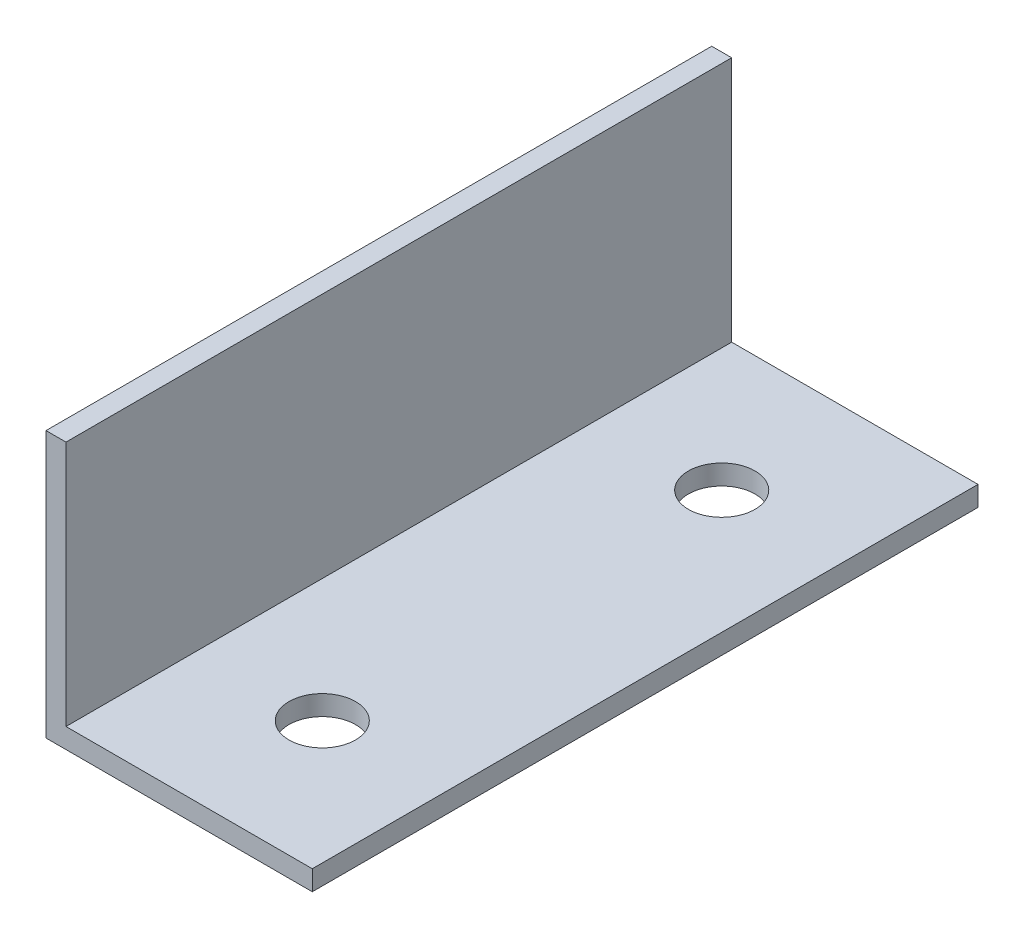
ISO-10303-21;
HEADER;
FILE_DESCRIPTION(('STEP AP214'),'2;1');
FILE_NAME('part.step','',(''),(''),'','','');
FILE_SCHEMA(('AUTOMOTIVE_DESIGN { 1 0 10303 214 1 1 1 1 }'));
ENDSEC;
DATA;
#1=APPLICATION_CONTEXT('core data for automotive mechanical design processes');
#2=APPLICATION_PROTOCOL_DEFINITION('international standard','automotive_design',2000,#1);
#3=PRODUCT_CONTEXT('',#1,'mechanical');
#4=PRODUCT('Part','Part','',(#3));
#5=PRODUCT_RELATED_PRODUCT_CATEGORY('part','',(#4));
#6=PRODUCT_DEFINITION_FORMATION('','',#4);
#7=PRODUCT_DEFINITION_CONTEXT('part definition',#1,'design');
#8=PRODUCT_DEFINITION('design','',#6,#7);
#9=PRODUCT_DEFINITION_SHAPE('','',#8);
#10=(LENGTH_UNIT() NAMED_UNIT(*) SI_UNIT(.MILLI.,.METRE.));
#11=(NAMED_UNIT(*) PLANE_ANGLE_UNIT() SI_UNIT($,.RADIAN.));
#12=(NAMED_UNIT(*) SI_UNIT($,.STERADIAN.) SOLID_ANGLE_UNIT());
#13=UNCERTAINTY_MEASURE_WITH_UNIT(LENGTH_MEASURE(1.E-05),#10,'distance_accuracy_value','');
#14=(GEOMETRIC_REPRESENTATION_CONTEXT(3) GLOBAL_UNCERTAINTY_ASSIGNED_CONTEXT((#13)) GLOBAL_UNIT_ASSIGNED_CONTEXT((#10,
#11,#12)) REPRESENTATION_CONTEXT('',''));
#15=CARTESIAN_POINT('',(0.,0.,0.));
#16=DIRECTION('',(0.,0.,1.));
#17=DIRECTION('',(1.,0.,0.));
#18=AXIS2_PLACEMENT_3D('',#15,#16,#17);
#19=CARTESIAN_POINT('',(40.,0.,100.));
#20=DIRECTION('',(0.,1.,0.));
#21=DIRECTION('',(-1.,0.,0.));
#22=AXIS2_PLACEMENT_3D('',#19,#20,#21);
#23=PLANE('',#22);
#24=CARTESIAN_POINT('',(21.5,0.,80.));
#25=DIRECTION('',(0.,1.,0.));
#26=DIRECTION('',(-1.,0.,0.));
#27=AXIS2_PLACEMENT_3D('',#24,#25,#26);
#28=CIRCLE('',#27,5.);
#29=CARTESIAN_POINT('',(16.5,0.,80.));
#30=VERTEX_POINT('',#29);
#31=EDGE_CURVE('E164',#30,#30,#28,.F.);
#32=ORIENTED_EDGE('',*,*,#31,.F.);
#33=EDGE_LOOP('',(#32));
#34=FACE_BOUND('',#33,.T.);
#35=CARTESIAN_POINT('',(21.5,0.,20.));
#36=DIRECTION('',(0.,1.,0.));
#37=DIRECTION('',(-1.,0.,0.));
#38=AXIS2_PLACEMENT_3D('',#35,#36,#37);
#39=CIRCLE('',#38,5.);
#40=CARTESIAN_POINT('',(16.5,0.,20.));
#41=VERTEX_POINT('',#40);
#42=EDGE_CURVE('E125',#41,#41,#39,.F.);
#43=ORIENTED_EDGE('',*,*,#42,.F.);
#44=EDGE_LOOP('',(#43));
#45=FACE_BOUND('',#44,.T.);
#46=DIRECTION('',(1.,0.,0.));
#47=VECTOR('',#46,1.);
#48=CARTESIAN_POINT('',(40.,0.,0.));
#49=LINE('',#48,#47);
#50=CARTESIAN_POINT('',(0.,0.,0.));
#51=VERTEX_POINT('',#50);
#52=CARTESIAN_POINT('',(40.,0.,0.));
#53=VERTEX_POINT('',#52);
#54=EDGE_CURVE('E121',#51,#53,#49,.T.);
#55=ORIENTED_EDGE('',*,*,#54,.T.);
#56=DIRECTION('',(0.,0.,-1.));
#57=VECTOR('',#56,1.);
#58=CARTESIAN_POINT('',(40.,0.,100.));
#59=LINE('',#58,#57);
#60=CARTESIAN_POINT('',(40.,0.,100.));
#61=VERTEX_POINT('',#60);
#62=EDGE_CURVE('E11',#61,#53,#59,.T.);
#63=ORIENTED_EDGE('',*,*,#62,.F.);
#64=DIRECTION('',(1.,0.,0.));
#65=VECTOR('',#64,1.);
#66=CARTESIAN_POINT('',(40.,0.,100.));
#67=LINE('',#66,#65);
#68=CARTESIAN_POINT('',(0.,0.,100.));
#69=VERTEX_POINT('',#68);
#70=EDGE_CURVE('E132',#69,#61,#67,.T.);
#71=ORIENTED_EDGE('',*,*,#70,.F.);
#72=DIRECTION('',(0.,0.,-1.));
#73=VECTOR('',#72,1.);
#74=CARTESIAN_POINT('',(0.,0.,100.));
#75=LINE('',#74,#73);
#76=EDGE_CURVE('E117',#69,#51,#75,.T.);
#77=ORIENTED_EDGE('',*,*,#76,.T.);
#78=EDGE_LOOP('',(#55,#63,#71,#77));
#79=FACE_BOUND('',#78,.T.);
#80=ADVANCED_FACE('F37',(#34,#45,#79),#23,.F.);
#81=CARTESIAN_POINT('',(40.,3.,100.));
#82=DIRECTION('',(-1.,0.,0.));
#83=DIRECTION('',(0.,0.,1.));
#84=AXIS2_PLACEMENT_3D('',#81,#82,#83);
#85=PLANE('',#84);
#86=DIRECTION('',(0.,1.,0.));
#87=VECTOR('',#86,1.);
#88=CARTESIAN_POINT('',(40.,3.,0.));
#89=LINE('',#88,#87);
#90=CARTESIAN_POINT('',(40.,3.,0.));
#91=VERTEX_POINT('',#90);
#92=EDGE_CURVE('E124',#53,#91,#89,.T.);
#93=ORIENTED_EDGE('',*,*,#92,.T.);
#94=DIRECTION('',(0.,0.,-1.));
#95=VECTOR('',#94,1.);
#96=CARTESIAN_POINT('',(40.,3.,100.));
#97=LINE('',#96,#95);
#98=CARTESIAN_POINT('',(40.,3.,100.));
#99=VERTEX_POINT('',#98);
#100=EDGE_CURVE('E45',#99,#91,#97,.T.);
#101=ORIENTED_EDGE('',*,*,#100,.F.);
#102=DIRECTION('',(0.,1.,0.));
#103=VECTOR('',#102,1.);
#104=CARTESIAN_POINT('',(40.,3.,100.));
#105=LINE('',#104,#103);
#106=EDGE_CURVE('E90',#61,#99,#105,.T.);
#107=ORIENTED_EDGE('',*,*,#106,.F.);
#108=ORIENTED_EDGE('',*,*,#62,.T.);
#109=EDGE_LOOP('',(#93,#101,#107,#108));
#110=FACE_BOUND('',#109,.T.);
#111=ADVANCED_FACE('F156',(#110),#85,.F.);
#112=CARTESIAN_POINT('',(3.,3.,100.));
#113=DIRECTION('',(0.,-1.,0.));
#114=DIRECTION('',(1.,0.,0.));
#115=AXIS2_PLACEMENT_3D('',#112,#113,#114);
#116=PLANE('',#115);
#117=CARTESIAN_POINT('',(21.5,3.,80.));
#118=DIRECTION('',(0.,1.,0.));
#119=DIRECTION('',(-1.,0.,0.));
#120=AXIS2_PLACEMENT_3D('',#117,#118,#119);
#121=CIRCLE('',#120,5.);
#122=CARTESIAN_POINT('',(16.5,3.,80.));
#123=VERTEX_POINT('',#122);
#124=EDGE_CURVE('E176',#123,#123,#121,.T.);
#125=ORIENTED_EDGE('',*,*,#124,.F.);
#126=EDGE_LOOP('',(#125));
#127=FACE_BOUND('',#126,.T.);
#128=CARTESIAN_POINT('',(21.5,3.,20.));
#129=DIRECTION('',(0.,1.,0.));
#130=DIRECTION('',(-1.,0.,0.));
#131=AXIS2_PLACEMENT_3D('',#128,#129,#130);
#132=CIRCLE('',#131,5.);
#133=CARTESIAN_POINT('',(16.5,3.,20.));
#134=VERTEX_POINT('',#133);
#135=EDGE_CURVE('E168',#134,#134,#132,.T.);
#136=ORIENTED_EDGE('',*,*,#135,.F.);
#137=EDGE_LOOP('',(#136));
#138=FACE_BOUND('',#137,.T.);
#139=DIRECTION('',(-1.,0.,0.));
#140=VECTOR('',#139,1.);
#141=CARTESIAN_POINT('',(3.,3.,0.));
#142=LINE('',#141,#140);
#143=CARTESIAN_POINT('',(3.,3.,0.));
#144=VERTEX_POINT('',#143);
#145=EDGE_CURVE('E127',#91,#144,#142,.T.);
#146=ORIENTED_EDGE('',*,*,#145,.T.);
#147=DIRECTION('',(0.,0.,-1.));
#148=VECTOR('',#147,1.);
#149=CARTESIAN_POINT('',(3.,3.,100.));
#150=LINE('',#149,#148);
#151=CARTESIAN_POINT('',(3.,3.,100.));
#152=VERTEX_POINT('',#151);
#153=EDGE_CURVE('E112',#152,#144,#150,.T.);
#154=ORIENTED_EDGE('',*,*,#153,.F.);
#155=DIRECTION('',(-1.,0.,0.));
#156=VECTOR('',#155,1.);
#157=CARTESIAN_POINT('',(3.,3.,100.));
#158=LINE('',#157,#156);
#159=EDGE_CURVE('E103',#99,#152,#158,.T.);
#160=ORIENTED_EDGE('',*,*,#159,.F.);
#161=ORIENTED_EDGE('',*,*,#100,.T.);
#162=EDGE_LOOP('',(#146,#154,#160,#161));
#163=FACE_BOUND('',#162,.T.);
#164=ADVANCED_FACE('F138',(#127,#138,#163),#116,.F.);
#165=CARTESIAN_POINT('',(3.,40.,100.));
#166=DIRECTION('',(-1.,0.,0.));
#167=DIRECTION('',(0.,-1.,0.));
#168=AXIS2_PLACEMENT_3D('',#165,#166,#167);
#169=PLANE('',#168);
#170=DIRECTION('',(0.,1.,0.));
#171=VECTOR('',#170,1.);
#172=CARTESIAN_POINT('',(3.,40.,0.));
#173=LINE('',#172,#171);
#174=CARTESIAN_POINT('',(3.,40.,0.));
#175=VERTEX_POINT('',#174);
#176=EDGE_CURVE('E111',#144,#175,#173,.T.);
#177=ORIENTED_EDGE('',*,*,#176,.T.);
#178=DIRECTION('',(0.,0.,-1.));
#179=VECTOR('',#178,1.);
#180=CARTESIAN_POINT('',(3.,40.,100.));
#181=LINE('',#180,#179);
#182=CARTESIAN_POINT('',(3.,40.,100.));
#183=VERTEX_POINT('',#182);
#184=EDGE_CURVE('E108',#183,#175,#181,.T.);
#185=ORIENTED_EDGE('',*,*,#184,.F.);
#186=DIRECTION('',(0.,1.,0.));
#187=VECTOR('',#186,1.);
#188=CARTESIAN_POINT('',(3.,40.,100.));
#189=LINE('',#188,#187);
#190=EDGE_CURVE('E97',#152,#183,#189,.T.);
#191=ORIENTED_EDGE('',*,*,#190,.F.);
#192=ORIENTED_EDGE('',*,*,#153,.T.);
#193=EDGE_LOOP('',(#177,#185,#191,#192));
#194=FACE_BOUND('',#193,.T.);
#195=ADVANCED_FACE('F109',(#194),#169,.F.);
#196=CARTESIAN_POINT('',(0.,40.,100.));
#197=DIRECTION('',(0.,-1.,0.));
#198=DIRECTION('',(0.,0.,-1.));
#199=AXIS2_PLACEMENT_3D('',#196,#197,#198);
#200=PLANE('',#199);
#201=DIRECTION('',(-1.,0.,0.));
#202=VECTOR('',#201,1.);
#203=CARTESIAN_POINT('',(0.,40.,0.));
#204=LINE('',#203,#202);
#205=CARTESIAN_POINT('',(0.,40.,0.));
#206=VERTEX_POINT('',#205);
#207=EDGE_CURVE('E76',#175,#206,#204,.T.);
#208=ORIENTED_EDGE('',*,*,#207,.T.);
#209=DIRECTION('',(0.,0.,-1.));
#210=VECTOR('',#209,1.);
#211=CARTESIAN_POINT('',(0.,40.,100.));
#212=LINE('',#211,#210);
#213=CARTESIAN_POINT('',(0.,40.,100.));
#214=VERTEX_POINT('',#213);
#215=EDGE_CURVE('E113',#214,#206,#212,.T.);
#216=ORIENTED_EDGE('',*,*,#215,.F.);
#217=DIRECTION('',(-1.,0.,0.));
#218=VECTOR('',#217,1.);
#219=CARTESIAN_POINT('',(0.,40.,100.));
#220=LINE('',#219,#218);
#221=EDGE_CURVE('E101',#183,#214,#220,.T.);
#222=ORIENTED_EDGE('',*,*,#221,.F.);
#223=ORIENTED_EDGE('',*,*,#184,.T.);
#224=EDGE_LOOP('',(#208,#216,#222,#223));
#225=FACE_BOUND('',#224,.T.);
#226=ADVANCED_FACE('F115',(#225),#200,.F.);
#227=CARTESIAN_POINT('',(0.,0.,100.));
#228=DIRECTION('',(1.,0.,0.));
#229=DIRECTION('',(0.,0.,-1.));
#230=AXIS2_PLACEMENT_3D('',#227,#228,#229);
#231=PLANE('',#230);
#232=DIRECTION('',(0.,-1.,0.));
#233=VECTOR('',#232,1.);
#234=CARTESIAN_POINT('',(0.,0.,0.));
#235=LINE('',#234,#233);
#236=EDGE_CURVE('E82',#206,#51,#235,.T.);
#237=ORIENTED_EDGE('',*,*,#236,.T.);
#238=ORIENTED_EDGE('',*,*,#76,.F.);
#239=DIRECTION('',(0.,-1.,0.));
#240=VECTOR('',#239,1.);
#241=CARTESIAN_POINT('',(0.,0.,100.));
#242=LINE('',#241,#240);
#243=EDGE_CURVE('E53',#214,#69,#242,.T.);
#244=ORIENTED_EDGE('',*,*,#243,.F.);
#245=ORIENTED_EDGE('',*,*,#215,.T.);
#246=EDGE_LOOP('',(#237,#238,#244,#245));
#247=FACE_BOUND('',#246,.T.);
#248=ADVANCED_FACE('F145',(#247),#231,.F.);
#249=CARTESIAN_POINT('',(0.,0.,100.));
#250=DIRECTION('',(0.,0.,-1.));
#251=DIRECTION('',(-1.,0.,0.));
#252=AXIS2_PLACEMENT_3D('',#249,#250,#251);
#253=PLANE('',#252);
#254=ORIENTED_EDGE('',*,*,#70,.T.);
#255=ORIENTED_EDGE('',*,*,#106,.T.);
#256=ORIENTED_EDGE('',*,*,#159,.T.);
#257=ORIENTED_EDGE('',*,*,#190,.T.);
#258=ORIENTED_EDGE('',*,*,#221,.T.);
#259=ORIENTED_EDGE('',*,*,#243,.T.);
#260=EDGE_LOOP('',(#254,#255,#256,#257,#258,#259));
#261=FACE_BOUND('',#260,.T.);
#262=ADVANCED_FACE('F99',(#261),#253,.F.);
#263=CARTESIAN_POINT('',(0.,0.,0.));
#264=DIRECTION('',(0.,0.,-1.));
#265=DIRECTION('',(-1.,0.,0.));
#266=AXIS2_PLACEMENT_3D('',#263,#264,#265);
#267=PLANE('',#266);
#268=ORIENTED_EDGE('',*,*,#54,.F.);
#269=ORIENTED_EDGE('',*,*,#236,.F.);
#270=ORIENTED_EDGE('',*,*,#207,.F.);
#271=ORIENTED_EDGE('',*,*,#176,.F.);
#272=ORIENTED_EDGE('',*,*,#145,.F.);
#273=ORIENTED_EDGE('',*,*,#92,.F.);
#274=EDGE_LOOP('',(#268,#269,#270,#271,#272,#273));
#275=FACE_BOUND('',#274,.T.);
#276=ADVANCED_FACE('F141',(#275),#267,.T.);
#277=CARTESIAN_POINT('',(21.5,-0.00100000000000057,20.));
#278=DIRECTION('',(0.,1.,0.));
#279=DIRECTION('',(-1.,0.,0.));
#280=AXIS2_PLACEMENT_3D('',#277,#278,#279);
#281=CYLINDRICAL_SURFACE('',#280,5.);
#282=ORIENTED_EDGE('',*,*,#135,.T.);
#283=EDGE_LOOP('',(#282));
#284=FACE_BOUND('',#283,.T.);
#285=ORIENTED_EDGE('',*,*,#42,.T.);
#286=EDGE_LOOP('',(#285));
#287=FACE_BOUND('',#286,.T.);
#288=ADVANCED_FACE('F188',(#284,#287),#281,.F.);
#289=CARTESIAN_POINT('',(21.5,-0.00100000000000057,80.));
#290=DIRECTION('',(0.,1.,0.));
#291=DIRECTION('',(-1.,0.,0.));
#292=AXIS2_PLACEMENT_3D('',#289,#290,#291);
#293=CYLINDRICAL_SURFACE('',#292,5.);
#294=ORIENTED_EDGE('',*,*,#124,.T.);
#295=EDGE_LOOP('',(#294));
#296=FACE_BOUND('',#295,.T.);
#297=ORIENTED_EDGE('',*,*,#31,.T.);
#298=EDGE_LOOP('',(#297));
#299=FACE_BOUND('',#298,.T.);
#300=ADVANCED_FACE('F180',(#296,#299),#293,.F.);
#301=CLOSED_SHELL('',(#80,#111,#164,#195,#226,#248,#262,#276,#288,#300));
#302=MANIFOLD_SOLID_BREP('B2',#301);
#303=ADVANCED_BREP_SHAPE_REPRESENTATION('',(#18,#302),#14);
#304=SHAPE_DEFINITION_REPRESENTATION(#9,#303);
ENDSEC;
END-ISO-10303-21;
